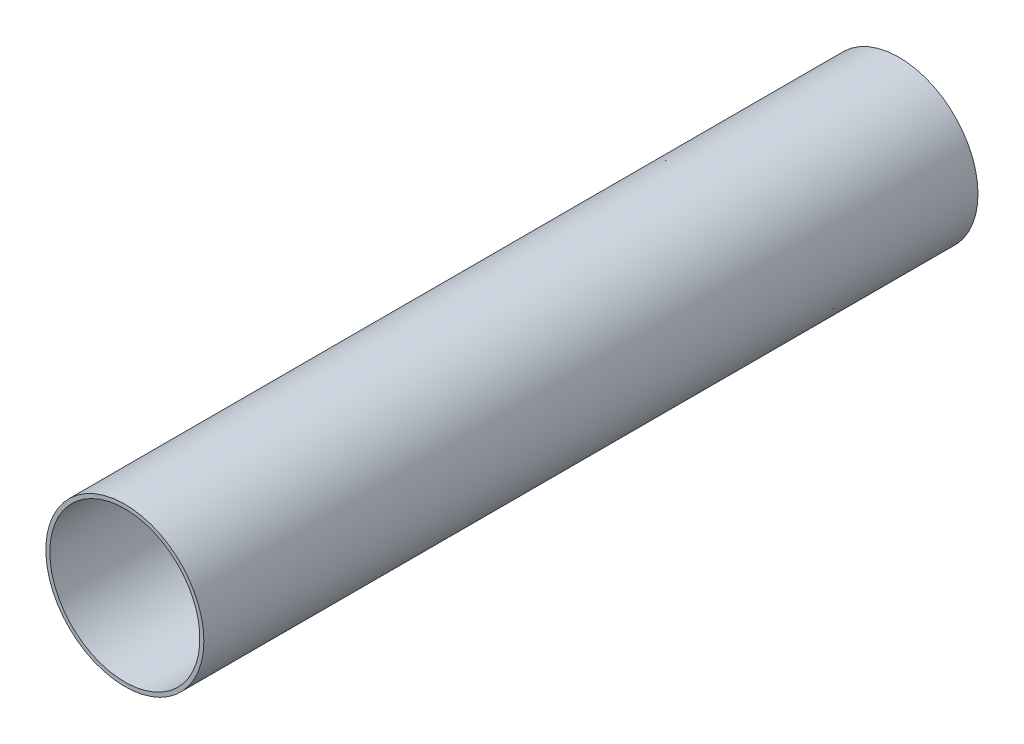
ISO-10303-21;
HEADER;
FILE_DESCRIPTION(('STEP AP214'),'2;1');
FILE_NAME('part.step','',(''),(''),'','','');
FILE_SCHEMA(('AUTOMOTIVE_DESIGN { 1 0 10303 214 1 1 1 1 }'));
ENDSEC;
DATA;
#1=APPLICATION_CONTEXT('core data for automotive mechanical design processes');
#2=APPLICATION_PROTOCOL_DEFINITION('international standard','automotive_design',2000,#1);
#3=PRODUCT_CONTEXT('',#1,'mechanical');
#4=PRODUCT('Part','Part','',(#3));
#5=PRODUCT_RELATED_PRODUCT_CATEGORY('part','',(#4));
#6=PRODUCT_DEFINITION_FORMATION('','',#4);
#7=PRODUCT_DEFINITION_CONTEXT('part definition',#1,'design');
#8=PRODUCT_DEFINITION('design','',#6,#7);
#9=PRODUCT_DEFINITION_SHAPE('','',#8);
#10=(LENGTH_UNIT() NAMED_UNIT(*) SI_UNIT(.MILLI.,.METRE.));
#11=(NAMED_UNIT(*) PLANE_ANGLE_UNIT() SI_UNIT($,.RADIAN.));
#12=(NAMED_UNIT(*) SI_UNIT($,.STERADIAN.) SOLID_ANGLE_UNIT());
#13=UNCERTAINTY_MEASURE_WITH_UNIT(LENGTH_MEASURE(1.E-05),#10,'distance_accuracy_value','');
#14=(GEOMETRIC_REPRESENTATION_CONTEXT(3) GLOBAL_UNCERTAINTY_ASSIGNED_CONTEXT((#13)) GLOBAL_UNIT_ASSIGNED_CONTEXT((#10,
#11,#12)) REPRESENTATION_CONTEXT('',''));
#15=CARTESIAN_POINT('',(0.,0.,0.));
#16=DIRECTION('',(0.,0.,1.));
#17=DIRECTION('',(1.,0.,0.));
#18=AXIS2_PLACEMENT_3D('',#15,#16,#17);
#19=CARTESIAN_POINT('',(0.,0.,245.));
#20=DIRECTION('',(0.,0.,-1.));
#21=DIRECTION('',(-1.,0.,0.));
#22=AXIS2_PLACEMENT_3D('',#19,#20,#21);
#23=CYLINDRICAL_SURFACE('',#22,50.);
#24=CARTESIAN_POINT('',(0.,0.,245.));
#25=DIRECTION('',(0.,0.,1.));
#26=DIRECTION('',(1.,0.,0.));
#27=AXIS2_PLACEMENT_3D('',#24,#25,#26);
#28=CIRCLE('',#27,50.);
#29=CARTESIAN_POINT('',(50.,0.,245.));
#30=VERTEX_POINT('',#29);
#31=EDGE_CURVE('E10',#30,#30,#28,.T.);
#32=ORIENTED_EDGE('',*,*,#31,.F.);
#33=EDGE_LOOP('',(#32));
#34=FACE_BOUND('',#33,.T.);
#35=CARTESIAN_POINT('',(0.,0.,-245.));
#36=DIRECTION('',(0.,0.,1.));
#37=DIRECTION('',(1.,0.,0.));
#38=AXIS2_PLACEMENT_3D('',#35,#36,#37);
#39=CIRCLE('',#38,50.);
#40=CARTESIAN_POINT('',(50.,0.,-245.));
#41=VERTEX_POINT('',#40);
#42=EDGE_CURVE('E41',#41,#41,#39,.T.);
#43=ORIENTED_EDGE('',*,*,#42,.T.);
#44=EDGE_LOOP('',(#43));
#45=FACE_BOUND('',#44,.T.);
#46=ADVANCED_FACE('F34',(#34,#45),#23,.T.);
#47=CARTESIAN_POINT('',(0.,0.,245.));
#48=DIRECTION('',(0.,0.,1.));
#49=DIRECTION('',(1.,0.,0.));
#50=AXIS2_PLACEMENT_3D('',#47,#48,#49);
#51=PLANE('',#50);
#52=CARTESIAN_POINT('',(0.,0.,245.));
#53=DIRECTION('',(0.,0.,-1.));
#54=DIRECTION('',(-1.,0.,0.));
#55=AXIS2_PLACEMENT_3D('',#52,#53,#54);
#56=CIRCLE('',#55,47.5);
#57=CARTESIAN_POINT('',(-47.5,0.,245.));
#58=VERTEX_POINT('',#57);
#59=EDGE_CURVE('E47',#58,#58,#56,.T.);
#60=ORIENTED_EDGE('',*,*,#59,.T.);
#61=EDGE_LOOP('',(#60));
#62=FACE_BOUND('',#61,.T.);
#63=ORIENTED_EDGE('',*,*,#31,.T.);
#64=EDGE_LOOP('',(#63));
#65=FACE_BOUND('',#64,.T.);
#66=ADVANCED_FACE('F64',(#62,#65),#51,.T.);
#67=CARTESIAN_POINT('',(0.,0.,-245.));
#68=DIRECTION('',(0.,0.,1.));
#69=DIRECTION('',(1.,0.,0.));
#70=AXIS2_PLACEMENT_3D('',#67,#68,#69);
#71=PLANE('',#70);
#72=CARTESIAN_POINT('',(0.,0.,-245.));
#73=DIRECTION('',(0.,0.,1.));
#74=DIRECTION('',(1.,0.,0.));
#75=AXIS2_PLACEMENT_3D('',#72,#73,#74);
#76=CIRCLE('',#75,47.5);
#77=CARTESIAN_POINT('',(47.5,0.,-245.));
#78=VERTEX_POINT('',#77);
#79=EDGE_CURVE('E37',#78,#78,#76,.T.);
#80=ORIENTED_EDGE('',*,*,#79,.T.);
#81=EDGE_LOOP('',(#80));
#82=FACE_BOUND('',#81,.T.);
#83=ORIENTED_EDGE('',*,*,#42,.F.);
#84=EDGE_LOOP('',(#83));
#85=FACE_BOUND('',#84,.T.);
#86=ADVANCED_FACE('F54',(#82,#85),#71,.F.);
#87=CARTESIAN_POINT('',(0.,0.,245.));
#88=DIRECTION('',(0.,0.,-1.));
#89=DIRECTION('',(-1.,0.,0.));
#90=AXIS2_PLACEMENT_3D('',#87,#88,#89);
#91=CYLINDRICAL_SURFACE('',#90,47.5);
#92=ORIENTED_EDGE('',*,*,#59,.F.);
#93=EDGE_LOOP('',(#92));
#94=FACE_BOUND('',#93,.T.);
#95=ORIENTED_EDGE('',*,*,#79,.F.);
#96=EDGE_LOOP('',(#95));
#97=FACE_BOUND('',#96,.T.);
#98=ADVANCED_FACE('F57',(#94,#97),#91,.F.);
#99=CLOSED_SHELL('',(#46,#66,#86,#98));
#100=MANIFOLD_SOLID_BREP('B2',#99);
#101=ADVANCED_BREP_SHAPE_REPRESENTATION('',(#18,#100),#14);
#102=SHAPE_DEFINITION_REPRESENTATION(#9,#101);
ENDSEC;
END-ISO-10303-21;
